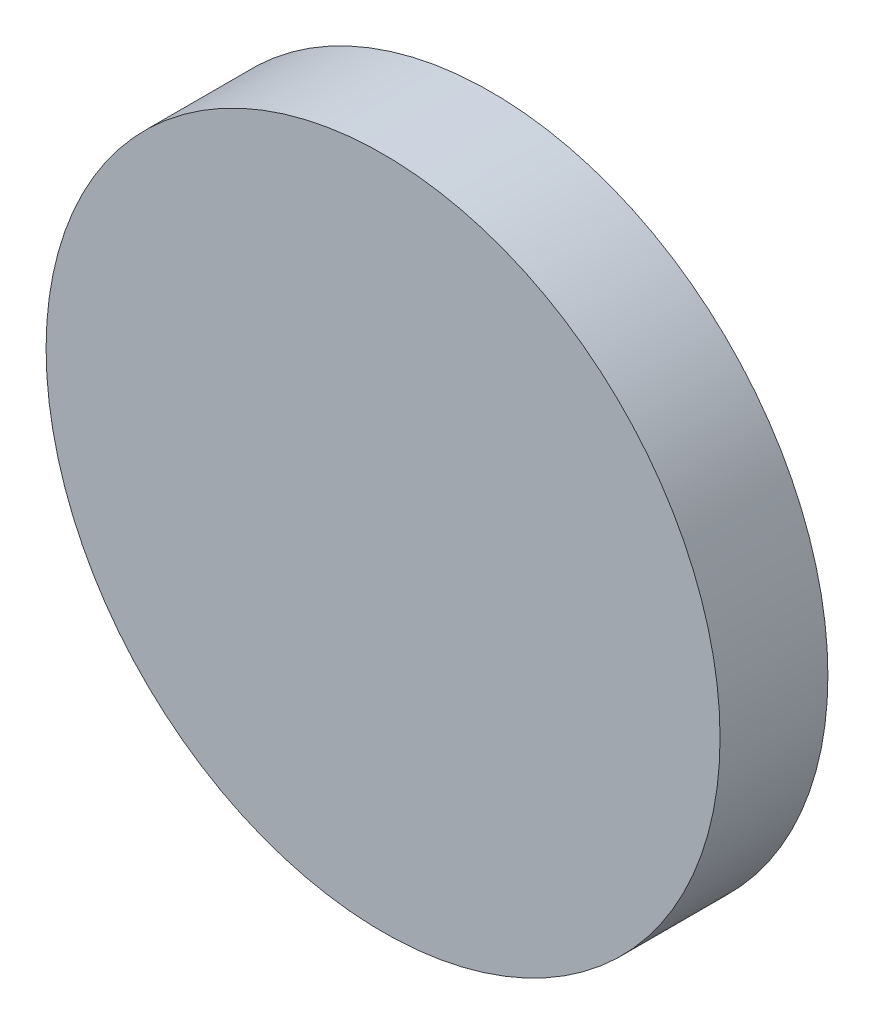
ISO-10303-21;
HEADER;
FILE_DESCRIPTION(('STEP AP214'),'2;1');
FILE_NAME('part.step','',(''),(''),'','','');
FILE_SCHEMA(('AUTOMOTIVE_DESIGN { 1 0 10303 214 1 1 1 1 }'));
ENDSEC;
DATA;
#1=APPLICATION_CONTEXT('core data for automotive mechanical design processes');
#2=APPLICATION_PROTOCOL_DEFINITION('international standard','automotive_design',2000,#1);
#3=PRODUCT_CONTEXT('',#1,'mechanical');
#4=PRODUCT('Part','Part','',(#3));
#5=PRODUCT_RELATED_PRODUCT_CATEGORY('part','',(#4));
#6=PRODUCT_DEFINITION_FORMATION('','',#4);
#7=PRODUCT_DEFINITION_CONTEXT('part definition',#1,'design');
#8=PRODUCT_DEFINITION('design','',#6,#7);
#9=PRODUCT_DEFINITION_SHAPE('','',#8);
#10=(LENGTH_UNIT() NAMED_UNIT(*) SI_UNIT(.MILLI.,.METRE.));
#11=(NAMED_UNIT(*) PLANE_ANGLE_UNIT() SI_UNIT($,.RADIAN.));
#12=(NAMED_UNIT(*) SI_UNIT($,.STERADIAN.) SOLID_ANGLE_UNIT());
#13=UNCERTAINTY_MEASURE_WITH_UNIT(LENGTH_MEASURE(1.E-05),#10,'distance_accuracy_value','');
#14=(GEOMETRIC_REPRESENTATION_CONTEXT(3) GLOBAL_UNCERTAINTY_ASSIGNED_CONTEXT((#13)) GLOBAL_UNIT_ASSIGNED_CONTEXT((#10,
#11,#12)) REPRESENTATION_CONTEXT('',''));
#15=CARTESIAN_POINT('',(0.,0.,0.));
#16=DIRECTION('',(0.,0.,1.));
#17=DIRECTION('',(1.,0.,0.));
#18=AXIS2_PLACEMENT_3D('',#15,#16,#17);
#19=CARTESIAN_POINT('',(0.,0.,2.));
#20=DIRECTION('',(0.,0.,-1.));
#21=DIRECTION('',(-1.,0.,0.));
#22=AXIS2_PLACEMENT_3D('',#19,#20,#21);
#23=CYLINDRICAL_SURFACE('',#22,6.25);
#24=CARTESIAN_POINT('',(0.,0.,2.));
#25=DIRECTION('',(0.,0.,1.));
#26=DIRECTION('',(1.,0.,0.));
#27=AXIS2_PLACEMENT_3D('',#24,#25,#26);
#28=CIRCLE('',#27,6.25);
#29=CARTESIAN_POINT('',(6.25,0.,2.));
#30=VERTEX_POINT('',#29);
#31=EDGE_CURVE('E10',#30,#30,#28,.T.);
#32=ORIENTED_EDGE('',*,*,#31,.F.);
#33=EDGE_LOOP('',(#32));
#34=FACE_BOUND('',#33,.T.);
#35=CARTESIAN_POINT('',(0.,0.,0.));
#36=DIRECTION('',(0.,0.,1.));
#37=DIRECTION('',(1.,0.,0.));
#38=AXIS2_PLACEMENT_3D('',#35,#36,#37);
#39=CIRCLE('',#38,6.25);
#40=CARTESIAN_POINT('',(6.25,0.,0.));
#41=VERTEX_POINT('',#40);
#42=EDGE_CURVE('E40',#41,#41,#39,.T.);
#43=ORIENTED_EDGE('',*,*,#42,.T.);
#44=EDGE_LOOP('',(#43));
#45=FACE_BOUND('',#44,.T.);
#46=ADVANCED_FACE('F37',(#34,#45),#23,.T.);
#47=CARTESIAN_POINT('',(0.,0.,2.));
#48=DIRECTION('',(0.,0.,1.));
#49=DIRECTION('',(1.,0.,0.));
#50=AXIS2_PLACEMENT_3D('',#47,#48,#49);
#51=PLANE('',#50);
#52=ORIENTED_EDGE('',*,*,#31,.T.);
#53=EDGE_LOOP('',(#52));
#54=FACE_BOUND('',#53,.T.);
#55=ADVANCED_FACE('F54',(#54),#51,.T.);
#56=CARTESIAN_POINT('',(0.,0.,0.));
#57=DIRECTION('',(0.,0.,1.));
#58=DIRECTION('',(1.,0.,0.));
#59=AXIS2_PLACEMENT_3D('',#56,#57,#58);
#60=PLANE('',#59);
#61=ORIENTED_EDGE('',*,*,#42,.F.);
#62=EDGE_LOOP('',(#61));
#63=FACE_BOUND('',#62,.T.);
#64=ADVANCED_FACE('F52',(#63),#60,.F.);
#65=CLOSED_SHELL('',(#46,#55,#64));
#66=MANIFOLD_SOLID_BREP('B2',#65);
#67=ADVANCED_BREP_SHAPE_REPRESENTATION('',(#18,#66),#14);
#68=SHAPE_DEFINITION_REPRESENTATION(#9,#67);
ENDSEC;
END-ISO-10303-21;
